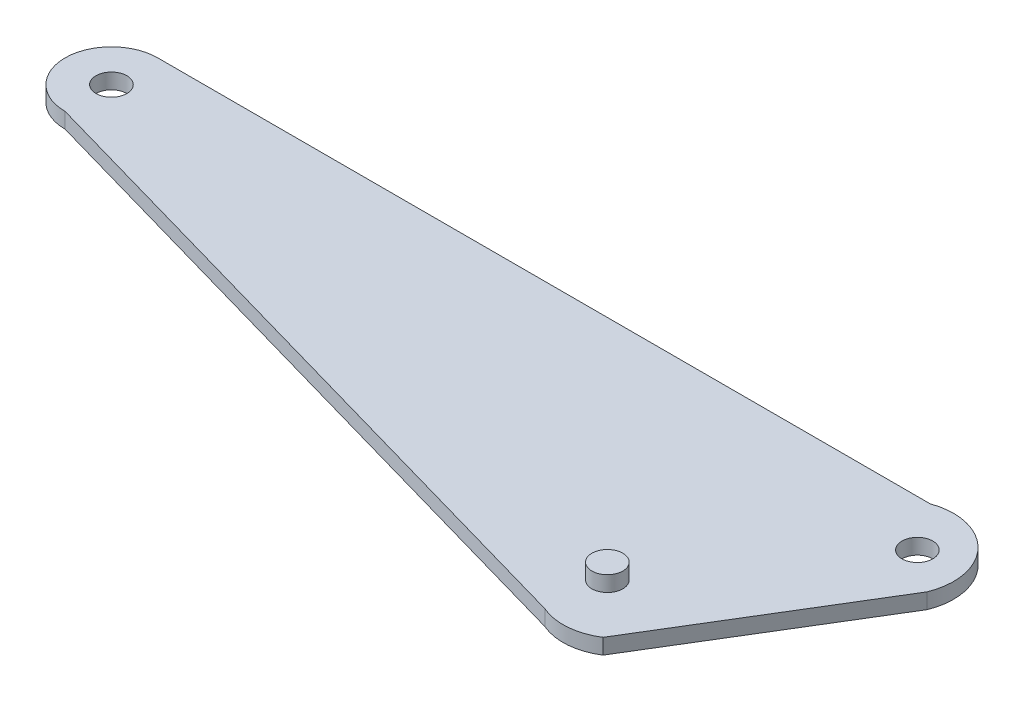
ISO-10303-21;
HEADER;
FILE_DESCRIPTION(('STEP AP214'),'2;1');
FILE_NAME('part.step','',(''),(''),'','','');
FILE_SCHEMA(('AUTOMOTIVE_DESIGN { 1 0 10303 214 1 1 1 1 }'));
ENDSEC;
DATA;
#1=APPLICATION_CONTEXT('core data for automotive mechanical design processes');
#2=APPLICATION_PROTOCOL_DEFINITION('international standard','automotive_design',2000,#1);
#3=PRODUCT_CONTEXT('',#1,'mechanical');
#4=PRODUCT('Part','Part','',(#3));
#5=PRODUCT_RELATED_PRODUCT_CATEGORY('part','',(#4));
#6=PRODUCT_DEFINITION_FORMATION('','',#4);
#7=PRODUCT_DEFINITION_CONTEXT('part definition',#1,'design');
#8=PRODUCT_DEFINITION('design','',#6,#7);
#9=PRODUCT_DEFINITION_SHAPE('','',#8);
#10=(LENGTH_UNIT() NAMED_UNIT(*) SI_UNIT(.MILLI.,.METRE.));
#11=(NAMED_UNIT(*) PLANE_ANGLE_UNIT() SI_UNIT($,.RADIAN.));
#12=(NAMED_UNIT(*) SI_UNIT($,.STERADIAN.) SOLID_ANGLE_UNIT());
#13=UNCERTAINTY_MEASURE_WITH_UNIT(LENGTH_MEASURE(1.E-05),#10,'distance_accuracy_value','');
#14=(GEOMETRIC_REPRESENTATION_CONTEXT(3) GLOBAL_UNCERTAINTY_ASSIGNED_CONTEXT((#13)) GLOBAL_UNIT_ASSIGNED_CONTEXT((#10,
#11,#12)) REPRESENTATION_CONTEXT('',''));
#15=CARTESIAN_POINT('',(0.,0.,0.));
#16=DIRECTION('',(0.,0.,1.));
#17=DIRECTION('',(1.,0.,0.));
#18=AXIS2_PLACEMENT_3D('',#15,#16,#17);
#19=CARTESIAN_POINT('',(-26.085,1.,0.));
#20=DIRECTION('',(0.,-1.,0.));
#21=DIRECTION('',(0.,0.,-1.));
#22=AXIS2_PLACEMENT_3D('',#19,#20,#21);
#23=CYLINDRICAL_SURFACE('',#22,1.);
#24=CARTESIAN_POINT('',(-26.085,1.,0.));
#25=DIRECTION('',(0.,1.,0.));
#26=DIRECTION('',(0.,0.,1.));
#27=AXIS2_PLACEMENT_3D('',#24,#25,#26);
#28=CIRCLE('',#27,1.);
#29=CARTESIAN_POINT('',(-26.085,1.,1.));
#30=VERTEX_POINT('',#29);
#31=EDGE_CURVE('E147',#30,#30,#28,.T.);
#32=ORIENTED_EDGE('',*,*,#31,.T.);
#33=EDGE_LOOP('',(#32));
#34=FACE_BOUND('',#33,.T.);
#35=CARTESIAN_POINT('',(-26.085,0.,0.));
#36=DIRECTION('',(0.,1.,0.));
#37=DIRECTION('',(0.,0.,1.));
#38=AXIS2_PLACEMENT_3D('',#35,#36,#37);
#39=CIRCLE('',#38,1.);
#40=CARTESIAN_POINT('',(-26.085,0.,1.));
#41=VERTEX_POINT('',#40);
#42=EDGE_CURVE('E179',#41,#41,#39,.T.);
#43=ORIENTED_EDGE('',*,*,#42,.F.);
#44=EDGE_LOOP('',(#43));
#45=FACE_BOUND('',#44,.T.);
#46=ADVANCED_FACE('F62',(#34,#45),#23,.F.);
#47=CARTESIAN_POINT('',(0.,1.,-3.));
#48=DIRECTION('',(0.,0.,-1.));
#49=DIRECTION('',(-1.,0.,0.));
#50=AXIS2_PLACEMENT_3D('',#47,#48,#49);
#51=PLANE('',#50);
#52=DIRECTION('',(1.,0.,0.));
#53=VECTOR('',#52,1.);
#54=CARTESIAN_POINT('',(0.,0.,-3.));
#55=LINE('',#54,#53);
#56=CARTESIAN_POINT('',(-26.085,0.,-3.));
#57=VERTEX_POINT('',#56);
#58=CARTESIAN_POINT('',(23.915,0.,-3.));
#59=VERTEX_POINT('',#58);
#60=EDGE_CURVE('E162',#57,#59,#55,.T.);
#61=ORIENTED_EDGE('',*,*,#60,.F.);
#62=DIRECTION('',(0.,-1.,0.));
#63=VECTOR('',#62,1.);
#64=CARTESIAN_POINT('',(-26.085,1.,-3.));
#65=LINE('',#64,#63);
#66=CARTESIAN_POINT('',(-26.085,1.,-3.));
#67=VERTEX_POINT('',#66);
#68=EDGE_CURVE('E72',#67,#57,#65,.T.);
#69=ORIENTED_EDGE('',*,*,#68,.F.);
#70=DIRECTION('',(1.,0.,0.));
#71=VECTOR('',#70,1.);
#72=CARTESIAN_POINT('',(0.,1.,-3.));
#73=LINE('',#72,#71);
#74=CARTESIAN_POINT('',(23.915,1.,-3.));
#75=VERTEX_POINT('',#74);
#76=EDGE_CURVE('E200',#67,#75,#73,.T.);
#77=ORIENTED_EDGE('',*,*,#76,.T.);
#78=DIRECTION('',(0.,-1.,0.));
#79=VECTOR('',#78,1.);
#80=CARTESIAN_POINT('',(23.915,1.,-3.));
#81=LINE('',#80,#79);
#82=EDGE_CURVE('E12',#75,#59,#81,.T.);
#83=ORIENTED_EDGE('',*,*,#82,.T.);
#84=EDGE_LOOP('',(#61,#69,#77,#83));
#85=FACE_BOUND('',#84,.T.);
#86=ADVANCED_FACE('F199',(#85),#51,.T.);
#87=CARTESIAN_POINT('',(-26.085,1.,0.));
#88=DIRECTION('',(0.,-1.,0.));
#89=DIRECTION('',(0.,0.,-1.));
#90=AXIS2_PLACEMENT_3D('',#87,#88,#89);
#91=CYLINDRICAL_SURFACE('',#90,3.);
#92=CARTESIAN_POINT('',(-26.085,0.,0.));
#93=DIRECTION('',(0.,1.,0.));
#94=DIRECTION('',(0.,0.,1.));
#95=AXIS2_PLACEMENT_3D('',#92,#93,#94);
#96=CIRCLE('',#95,3.);
#97=CARTESIAN_POINT('',(-26.085,0.,3.));
#98=VERTEX_POINT('',#97);
#99=EDGE_CURVE('E166',#57,#98,#96,.T.);
#100=ORIENTED_EDGE('',*,*,#99,.T.);
#101=DIRECTION('',(0.,-1.,0.));
#102=VECTOR('',#101,1.);
#103=CARTESIAN_POINT('',(-26.085,1.,3.));
#104=LINE('',#103,#102);
#105=CARTESIAN_POINT('',(-26.085,1.,3.));
#106=VERTEX_POINT('',#105);
#107=EDGE_CURVE('E140',#106,#98,#104,.T.);
#108=ORIENTED_EDGE('',*,*,#107,.F.);
#109=CARTESIAN_POINT('',(-26.085,1.,0.));
#110=DIRECTION('',(0.,1.,0.));
#111=DIRECTION('',(0.,0.,1.));
#112=AXIS2_PLACEMENT_3D('',#109,#110,#111);
#113=CIRCLE('',#112,3.);
#114=EDGE_CURVE('E127',#67,#106,#113,.T.);
#115=ORIENTED_EDGE('',*,*,#114,.F.);
#116=ORIENTED_EDGE('',*,*,#68,.T.);
#117=EDGE_LOOP('',(#100,#108,#115,#116));
#118=FACE_BOUND('',#117,.T.);
#119=ADVANCED_FACE('F192',(#118),#91,.T.);
#120=CARTESIAN_POINT('',(-2.74312649308922,1.,9.64123526346859));
#121=DIRECTION('',(0.273659164726169,0.,-0.961826731569349));
#122=DIRECTION('',(-0.961826731569349,0.,-0.273659164726169));
#123=AXIS2_PLACEMENT_3D('',#120,#121,#122);
#124=PLANE('',#123);
#125=DIRECTION('',(0.961826731569349,0.,0.273659164726169));
#126=VECTOR('',#125,1.);
#127=CARTESIAN_POINT('',(-2.74312649308922,0.,9.64123526346859));
#128=LINE('',#127,#126);
#129=CARTESIAN_POINT('',(17.3224610745458,0.,15.3503008916814));
#130=VERTEX_POINT('',#129);
#131=EDGE_CURVE('E136',#98,#130,#128,.T.);
#132=ORIENTED_EDGE('',*,*,#131,.T.);
#133=DIRECTION('',(0.,-1.,0.));
#134=VECTOR('',#133,1.);
#135=CARTESIAN_POINT('',(17.3224610745458,1.,15.3503008916814));
#136=LINE('',#135,#134);
#137=CARTESIAN_POINT('',(17.3224610745458,1.,15.3503008916814));
#138=VERTEX_POINT('',#137);
#139=EDGE_CURVE('E134',#138,#130,#136,.T.);
#140=ORIENTED_EDGE('',*,*,#139,.F.);
#141=DIRECTION('',(0.961826731569349,0.,0.273659164726169));
#142=VECTOR('',#141,1.);
#143=CARTESIAN_POINT('',(-2.74312649308922,1.,9.64123526346859));
#144=LINE('',#143,#142);
#145=EDGE_CURVE('E118',#106,#138,#144,.T.);
#146=ORIENTED_EDGE('',*,*,#145,.F.);
#147=ORIENTED_EDGE('',*,*,#107,.T.);
#148=EDGE_LOOP('',(#132,#140,#146,#147));
#149=FACE_BOUND('',#148,.T.);
#150=ADVANCED_FACE('F135',(#149),#124,.F.);
#151=CARTESIAN_POINT('',(18.8041872051164,1.,11.9578327905126));
#152=DIRECTION('',(0.,-1.,0.));
#153=DIRECTION('',(0.,0.,-1.));
#154=AXIS2_PLACEMENT_3D('',#151,#152,#153);
#155=CYLINDRICAL_SURFACE('',#154,3.70193897079125);
#156=CARTESIAN_POINT('',(18.8041872051164,0.,11.9578327905126));
#157=DIRECTION('',(0.,1.,0.));
#158=DIRECTION('',(0.,0.,1.));
#159=AXIS2_PLACEMENT_3D('',#156,#157,#158);
#160=CIRCLE('',#159,3.70193897079125);
#161=CARTESIAN_POINT('',(20.8126405025531,0.,15.0675703189029));
#162=VERTEX_POINT('',#161);
#163=EDGE_CURVE('E172',#162,#130,#160,.F.);
#164=ORIENTED_EDGE('',*,*,#163,.F.);
#165=DIRECTION('',(0.,-1.,0.));
#166=VECTOR('',#165,1.);
#167=CARTESIAN_POINT('',(20.8126405025531,1.,15.0675703189029));
#168=LINE('',#167,#166);
#169=CARTESIAN_POINT('',(20.8126405025531,1.,15.0675703189029));
#170=VERTEX_POINT('',#169);
#171=EDGE_CURVE('E99',#170,#162,#168,.T.);
#172=ORIENTED_EDGE('',*,*,#171,.F.);
#173=CARTESIAN_POINT('',(18.8041872051164,1.,11.9578327905126));
#174=DIRECTION('',(0.,1.,0.));
#175=DIRECTION('',(0.,0.,1.));
#176=AXIS2_PLACEMENT_3D('',#173,#174,#175);
#177=CIRCLE('',#176,3.70193897079125);
#178=EDGE_CURVE('E124',#170,#138,#177,.F.);
#179=ORIENTED_EDGE('',*,*,#178,.T.);
#180=ORIENTED_EDGE('',*,*,#139,.T.);
#181=EDGE_LOOP('',(#164,#172,#179,#180));
#182=FACE_BOUND('',#181,.T.);
#183=ADVANCED_FACE('F142',(#182),#155,.T.);
#184=CARTESIAN_POINT('',(21.8766253183052,1.,13.3201071060939));
#185=DIRECTION('',(0.854130913608047,0.,0.520058056777398));
#186=DIRECTION('',(0.520058056777398,0.,-0.854130913608047));
#187=AXIS2_PLACEMENT_3D('',#184,#185,#186);
#188=PLANE('',#187);
#189=DIRECTION('',(-0.520058056777398,0.,0.854130913608047));
#190=VECTOR('',#189,1.);
#191=CARTESIAN_POINT('',(21.8766253183052,0.,13.3201071060939));
#192=LINE('',#191,#190);
#193=CARTESIAN_POINT('',(28.7436657689284,0.,2.04184411711239));
#194=VERTEX_POINT('',#193);
#195=EDGE_CURVE('E175',#194,#162,#192,.T.);
#196=ORIENTED_EDGE('',*,*,#195,.F.);
#197=DIRECTION('',(0.,-1.,0.));
#198=VECTOR('',#197,1.);
#199=CARTESIAN_POINT('',(28.7436657689284,1.,2.04184411711239));
#200=LINE('',#199,#198);
#201=CARTESIAN_POINT('',(28.7436657689284,1.,2.04184411711239));
#202=VERTEX_POINT('',#201);
#203=EDGE_CURVE('E80',#202,#194,#200,.T.);
#204=ORIENTED_EDGE('',*,*,#203,.F.);
#205=DIRECTION('',(-0.520058056777398,0.,0.854130913608047));
#206=VECTOR('',#205,1.);
#207=CARTESIAN_POINT('',(21.8766253183052,1.,13.3201071060939));
#208=LINE('',#207,#206);
#209=EDGE_CURVE('E144',#202,#170,#208,.T.);
#210=ORIENTED_EDGE('',*,*,#209,.T.);
#211=ORIENTED_EDGE('',*,*,#171,.T.);
#212=EDGE_LOOP('',(#196,#204,#210,#211));
#213=FACE_BOUND('',#212,.T.);
#214=ADVANCED_FACE('F202',(#213),#188,.T.);
#215=CARTESIAN_POINT('',(25.2057098682892,1.,0.597036247999214));
#216=DIRECTION('',(0.,-1.,0.));
#217=DIRECTION('',(0.,0.,-1.));
#218=AXIS2_PLACEMENT_3D('',#215,#216,#217);
#219=CYLINDRICAL_SURFACE('',#218,3.82159675181975);
#220=CARTESIAN_POINT('',(25.2057098682892,0.,0.597036247999214));
#221=DIRECTION('',(0.,1.,0.));
#222=DIRECTION('',(0.,0.,1.));
#223=AXIS2_PLACEMENT_3D('',#220,#221,#222);
#224=CIRCLE('',#223,3.82159675181975);
#225=EDGE_CURVE('E158',#59,#194,#224,.F.);
#226=ORIENTED_EDGE('',*,*,#225,.F.);
#227=ORIENTED_EDGE('',*,*,#82,.F.);
#228=CARTESIAN_POINT('',(25.2057098682892,1.,0.597036247999214));
#229=DIRECTION('',(0.,1.,0.));
#230=DIRECTION('',(0.,0.,1.));
#231=AXIS2_PLACEMENT_3D('',#228,#229,#230);
#232=CIRCLE('',#231,3.82159675181975);
#233=EDGE_CURVE('E246',#75,#202,#232,.F.);
#234=ORIENTED_EDGE('',*,*,#233,.T.);
#235=ORIENTED_EDGE('',*,*,#203,.T.);
#236=EDGE_LOOP('',(#226,#227,#234,#235));
#237=FACE_BOUND('',#236,.T.);
#238=ADVANCED_FACE('F201',(#237),#219,.T.);
#239=CARTESIAN_POINT('',(26.085,1.,0.));
#240=DIRECTION('',(0.,-1.,0.));
#241=DIRECTION('',(0.,0.,-1.));
#242=AXIS2_PLACEMENT_3D('',#239,#240,#241);
#243=CYLINDRICAL_SURFACE('',#242,0.999999999999998);
#244=CARTESIAN_POINT('',(26.085,1.,0.));
#245=DIRECTION('',(0.,1.,0.));
#246=DIRECTION('',(0.,0.,1.));
#247=AXIS2_PLACEMENT_3D('',#244,#245,#246);
#248=CIRCLE('',#247,0.999999999999998);
#249=CARTESIAN_POINT('',(26.085,1.,0.999999999999988));
#250=VERTEX_POINT('',#249);
#251=EDGE_CURVE('E183',#250,#250,#248,.T.);
#252=ORIENTED_EDGE('',*,*,#251,.T.);
#253=EDGE_LOOP('',(#252));
#254=FACE_BOUND('',#253,.T.);
#255=CARTESIAN_POINT('',(26.085,0.,0.));
#256=DIRECTION('',(0.,1.,0.));
#257=DIRECTION('',(0.,0.,1.));
#258=AXIS2_PLACEMENT_3D('',#255,#256,#257);
#259=CIRCLE('',#258,0.999999999999998);
#260=CARTESIAN_POINT('',(26.085,0.,0.999999999999988));
#261=VERTEX_POINT('',#260);
#262=EDGE_CURVE('E154',#261,#261,#259,.T.);
#263=ORIENTED_EDGE('',*,*,#262,.F.);
#264=EDGE_LOOP('',(#263));
#265=FACE_BOUND('',#264,.T.);
#266=ADVANCED_FACE('F64',(#254,#265),#243,.F.);
#267=CARTESIAN_POINT('',(0.,0.,0.));
#268=DIRECTION('',(0.,1.,0.));
#269=DIRECTION('',(0.,0.,1.));
#270=AXIS2_PLACEMENT_3D('',#267,#268,#269);
#271=PLANE('',#270);
#272=ORIENTED_EDGE('',*,*,#262,.T.);
#273=EDGE_LOOP('',(#272));
#274=FACE_BOUND('',#273,.T.);
#275=ORIENTED_EDGE('',*,*,#225,.T.);
#276=ORIENTED_EDGE('',*,*,#195,.T.);
#277=ORIENTED_EDGE('',*,*,#163,.T.);
#278=ORIENTED_EDGE('',*,*,#131,.F.);
#279=ORIENTED_EDGE('',*,*,#99,.F.);
#280=ORIENTED_EDGE('',*,*,#60,.T.);
#281=EDGE_LOOP('',(#275,#276,#277,#278,#279,#280));
#282=FACE_BOUND('',#281,.T.);
#283=ORIENTED_EDGE('',*,*,#42,.T.);
#284=EDGE_LOOP('',(#283));
#285=FACE_BOUND('',#284,.T.);
#286=ADVANCED_FACE('F197',(#274,#282,#285),#271,.F.);
#287=CARTESIAN_POINT('',(0.,1.,0.));
#288=DIRECTION('',(0.,1.,0.));
#289=DIRECTION('',(0.,0.,1.));
#290=AXIS2_PLACEMENT_3D('',#287,#288,#289);
#291=PLANE('',#290);
#292=CARTESIAN_POINT('',(17.732709604525,1.,11.7153266454864));
#293=DIRECTION('',(0.,1.,0.));
#294=DIRECTION('',(0.,0.,1.));
#295=AXIS2_PLACEMENT_3D('',#292,#293,#294);
#296=CIRCLE('',#295,1.);
#297=CARTESIAN_POINT('',(17.732709604525,1.,12.7153266454864));
#298=VERTEX_POINT('',#297);
#299=EDGE_CURVE('E237',#298,#298,#296,.T.);
#300=ORIENTED_EDGE('',*,*,#299,.F.);
#301=EDGE_LOOP('',(#300));
#302=FACE_BOUND('',#301,.T.);
#303=ORIENTED_EDGE('',*,*,#251,.F.);
#304=EDGE_LOOP('',(#303));
#305=FACE_BOUND('',#304,.T.);
#306=ORIENTED_EDGE('',*,*,#233,.F.);
#307=ORIENTED_EDGE('',*,*,#76,.F.);
#308=ORIENTED_EDGE('',*,*,#114,.T.);
#309=ORIENTED_EDGE('',*,*,#145,.T.);
#310=ORIENTED_EDGE('',*,*,#178,.F.);
#311=ORIENTED_EDGE('',*,*,#209,.F.);
#312=EDGE_LOOP('',(#306,#307,#308,#309,#310,#311));
#313=FACE_BOUND('',#312,.T.);
#314=ORIENTED_EDGE('',*,*,#31,.F.);
#315=EDGE_LOOP('',(#314));
#316=FACE_BOUND('',#315,.T.);
#317=ADVANCED_FACE('F120',(#302,#305,#313,#316),#291,.T.);
#318=CARTESIAN_POINT('',(17.732709604525,2.,11.7153266454864));
#319=DIRECTION('',(0.,-1.,0.));
#320=DIRECTION('',(0.,0.,-1.));
#321=AXIS2_PLACEMENT_3D('',#318,#319,#320);
#322=CYLINDRICAL_SURFACE('',#321,1.);
#323=CARTESIAN_POINT('',(17.732709604525,2.,11.7153266454864));
#324=DIRECTION('',(0.,1.,0.));
#325=DIRECTION('',(0.,0.,1.));
#326=AXIS2_PLACEMENT_3D('',#323,#324,#325);
#327=CIRCLE('',#326,1.);
#328=CARTESIAN_POINT('',(17.732709604525,2.,12.7153266454864));
#329=VERTEX_POINT('',#328);
#330=EDGE_CURVE('E159',#329,#329,#327,.T.);
#331=ORIENTED_EDGE('',*,*,#330,.F.);
#332=EDGE_LOOP('',(#331));
#333=FACE_BOUND('',#332,.T.);
#334=ORIENTED_EDGE('',*,*,#299,.T.);
#335=EDGE_LOOP('',(#334));
#336=FACE_BOUND('',#335,.T.);
#337=ADVANCED_FACE('F224',(#333,#336),#322,.T.);
#338=CARTESIAN_POINT('',(17.732709604525,2.,11.7153266454864));
#339=DIRECTION('',(0.,1.,0.));
#340=DIRECTION('',(0.,0.,1.));
#341=AXIS2_PLACEMENT_3D('',#338,#339,#340);
#342=PLANE('',#341);
#343=ORIENTED_EDGE('',*,*,#330,.T.);
#344=EDGE_LOOP('',(#343));
#345=FACE_BOUND('',#344,.T.);
#346=ADVANCED_FACE('F228',(#345),#342,.T.);
#347=CLOSED_SHELL('',(#46,#86,#119,#150,#183,#214,#238,#266,#286,#317,#337,#346));
#348=MANIFOLD_SOLID_BREP('B2',#347);
#349=ADVANCED_BREP_SHAPE_REPRESENTATION('',(#18,#348),#14);
#350=SHAPE_DEFINITION_REPRESENTATION(#9,#349);
ENDSEC;
END-ISO-10303-21;
